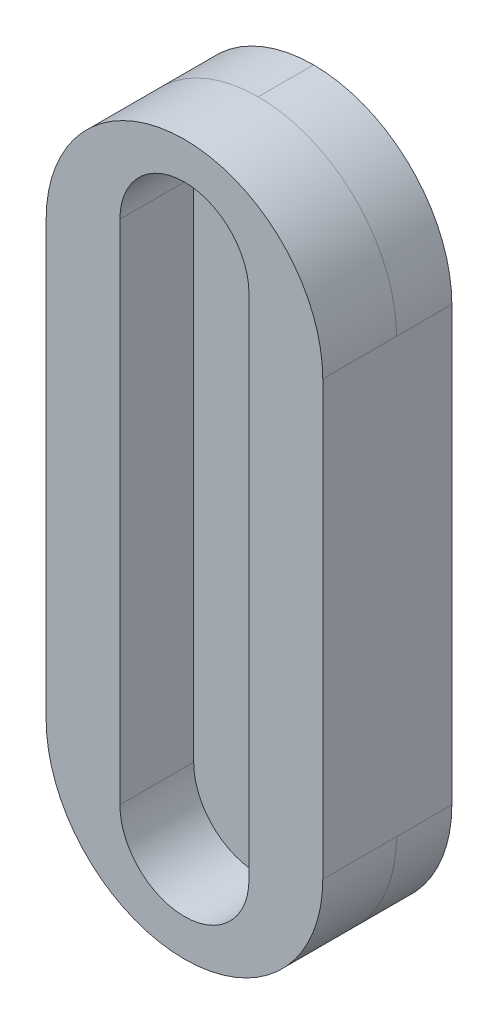
ISO-10303-21;
HEADER;
FILE_DESCRIPTION(('STEP AP214'),'2;1');
FILE_NAME('part.step','',(''),(''),'','','');
FILE_SCHEMA(('AUTOMOTIVE_DESIGN { 1 0 10303 214 1 1 1 1 }'));
ENDSEC;
DATA;
#1=APPLICATION_CONTEXT('core data for automotive mechanical design processes');
#2=APPLICATION_PROTOCOL_DEFINITION('international standard','automotive_design',2000,#1);
#3=PRODUCT_CONTEXT('',#1,'mechanical');
#4=PRODUCT('Part','Part','',(#3));
#5=PRODUCT_RELATED_PRODUCT_CATEGORY('part','',(#4));
#6=PRODUCT_DEFINITION_FORMATION('','',#4);
#7=PRODUCT_DEFINITION_CONTEXT('part definition',#1,'design');
#8=PRODUCT_DEFINITION('design','',#6,#7);
#9=PRODUCT_DEFINITION_SHAPE('','',#8);
#10=(LENGTH_UNIT() NAMED_UNIT(*) SI_UNIT(.MILLI.,.METRE.));
#11=(NAMED_UNIT(*) PLANE_ANGLE_UNIT() SI_UNIT($,.RADIAN.));
#12=(NAMED_UNIT(*) SI_UNIT($,.STERADIAN.) SOLID_ANGLE_UNIT());
#13=UNCERTAINTY_MEASURE_WITH_UNIT(LENGTH_MEASURE(1.E-05),#10,'distance_accuracy_value','');
#14=(GEOMETRIC_REPRESENTATION_CONTEXT(3) GLOBAL_UNCERTAINTY_ASSIGNED_CONTEXT((#13)) GLOBAL_UNIT_ASSIGNED_CONTEXT((#10,
#11,#12)) REPRESENTATION_CONTEXT('',''));
#15=CARTESIAN_POINT('',(0.,0.,0.));
#16=DIRECTION('',(0.,0.,1.));
#17=DIRECTION('',(1.,0.,0.));
#18=AXIS2_PLACEMENT_3D('',#15,#16,#17);
#19=CARTESIAN_POINT('',(3.75,0.,1.));
#20=DIRECTION('',(-1.,0.,0.));
#21=DIRECTION('',(0.,0.,1.));
#22=AXIS2_PLACEMENT_3D('',#19,#20,#21);
#23=PLANE('',#22);
#24=DIRECTION('',(0.,0.,-1.));
#25=VECTOR('',#24,1.);
#26=CARTESIAN_POINT('',(3.75,12.25,3.5));
#27=LINE('',#26,#25);
#28=CARTESIAN_POINT('',(3.75,12.25,3.5));
#29=VERTEX_POINT('',#28);
#30=CARTESIAN_POINT('',(3.75,12.25,1.5));
#31=VERTEX_POINT('',#30);
#32=EDGE_CURVE('E140',#29,#31,#27,.T.);
#33=ORIENTED_EDGE('',*,*,#32,.T.);
#34=DIRECTION('',(0.,0.,-1.));
#35=VECTOR('',#34,1.);
#36=CARTESIAN_POINT('',(3.75,12.25,1.));
#37=LINE('',#36,#35);
#38=CARTESIAN_POINT('',(3.75,12.25,0.));
#39=VERTEX_POINT('',#38);
#40=EDGE_CURVE('E198',#31,#39,#37,.T.);
#41=ORIENTED_EDGE('',*,*,#40,.T.);
#42=DIRECTION('',(0.,1.,0.));
#43=VECTOR('',#42,1.);
#44=CARTESIAN_POINT('',(3.75,0.,0.));
#45=LINE('',#44,#43);
#46=CARTESIAN_POINT('',(3.75,24.,0.));
#47=VERTEX_POINT('',#46);
#48=EDGE_CURVE('E182',#39,#47,#45,.T.);
#49=ORIENTED_EDGE('',*,*,#48,.T.);
#50=DIRECTION('',(0.,0.,-1.));
#51=VECTOR('',#50,1.);
#52=CARTESIAN_POINT('',(3.75,24.,1.));
#53=LINE('',#52,#51);
#54=CARTESIAN_POINT('',(3.75,24.,1.5));
#55=VERTEX_POINT('',#54);
#56=EDGE_CURVE('E194',#47,#55,#53,.F.);
#57=ORIENTED_EDGE('',*,*,#56,.T.);
#58=DIRECTION('',(0.,0.,-1.));
#59=VECTOR('',#58,1.);
#60=CARTESIAN_POINT('',(3.75,24.,3.5));
#61=LINE('',#60,#59);
#62=CARTESIAN_POINT('',(3.75,24.,3.5));
#63=VERTEX_POINT('',#62);
#64=EDGE_CURVE('E165',#63,#55,#61,.T.);
#65=ORIENTED_EDGE('',*,*,#64,.F.);
#66=DIRECTION('',(0.,1.,0.));
#67=VECTOR('',#66,1.);
#68=CARTESIAN_POINT('',(3.75,0.,3.5));
#69=LINE('',#68,#67);
#70=EDGE_CURVE('E144',#29,#63,#69,.T.);
#71=ORIENTED_EDGE('',*,*,#70,.F.);
#72=EDGE_LOOP('',(#33,#41,#49,#57,#65,#71));
#73=FACE_BOUND('',#72,.T.);
#74=ADVANCED_FACE('F41',(#73),#23,.F.);
#75=CARTESIAN_POINT('',(-3.75,0.,1.));
#76=DIRECTION('',(-1.,0.,0.));
#77=DIRECTION('',(0.,0.,1.));
#78=AXIS2_PLACEMENT_3D('',#75,#76,#77);
#79=PLANE('',#78);
#80=DIRECTION('',(0.,1.,0.));
#81=VECTOR('',#80,1.);
#82=CARTESIAN_POINT('',(-3.75,0.,0.));
#83=LINE('',#82,#81);
#84=CARTESIAN_POINT('',(-3.75,12.25,0.));
#85=VERTEX_POINT('',#84);
#86=CARTESIAN_POINT('',(-3.75,24.,0.));
#87=VERTEX_POINT('',#86);
#88=EDGE_CURVE('E186',#85,#87,#83,.T.);
#89=ORIENTED_EDGE('',*,*,#88,.F.);
#90=DIRECTION('',(0.,0.,-1.));
#91=VECTOR('',#90,1.);
#92=CARTESIAN_POINT('',(-3.75,12.25,1.5));
#93=LINE('',#92,#91);
#94=CARTESIAN_POINT('',(-3.75,12.25,1.5));
#95=VERTEX_POINT('',#94);
#96=EDGE_CURVE('E11',#85,#95,#93,.F.);
#97=ORIENTED_EDGE('',*,*,#96,.T.);
#98=DIRECTION('',(0.,0.,-1.));
#99=VECTOR('',#98,1.);
#100=CARTESIAN_POINT('',(-3.75,12.25,3.5));
#101=LINE('',#100,#99);
#102=CARTESIAN_POINT('',(-3.75,12.25,3.5));
#103=VERTEX_POINT('',#102);
#104=EDGE_CURVE('E137',#103,#95,#101,.T.);
#105=ORIENTED_EDGE('',*,*,#104,.F.);
#106=DIRECTION('',(0.,-1.,0.));
#107=VECTOR('',#106,1.);
#108=CARTESIAN_POINT('',(-3.75,0.,3.5));
#109=LINE('',#108,#107);
#110=CARTESIAN_POINT('',(-3.75,24.,3.5));
#111=VERTEX_POINT('',#110);
#112=EDGE_CURVE('E145',#111,#103,#109,.T.);
#113=ORIENTED_EDGE('',*,*,#112,.F.);
#114=DIRECTION('',(0.,0.,-1.));
#115=VECTOR('',#114,1.);
#116=CARTESIAN_POINT('',(-3.75,24.,3.5));
#117=LINE('',#116,#115);
#118=CARTESIAN_POINT('',(-3.75,24.,1.5));
#119=VERTEX_POINT('',#118);
#120=EDGE_CURVE('E265',#111,#119,#117,.T.);
#121=ORIENTED_EDGE('',*,*,#120,.T.);
#122=DIRECTION('',(0.,0.,-1.));
#123=VECTOR('',#122,1.);
#124=CARTESIAN_POINT('',(-3.75,24.,0.));
#125=LINE('',#124,#123);
#126=EDGE_CURVE('E51',#119,#87,#125,.T.);
#127=ORIENTED_EDGE('',*,*,#126,.T.);
#128=EDGE_LOOP('',(#89,#97,#105,#113,#121,#127));
#129=FACE_BOUND('',#128,.T.);
#130=ADVANCED_FACE('F156',(#129),#79,.T.);
#131=CARTESIAN_POINT('',(0.,24.,1.));
#132=DIRECTION('',(0.,0.,-1.));
#133=DIRECTION('',(-1.,0.,0.));
#134=AXIS2_PLACEMENT_3D('',#131,#132,#133);
#135=CYLINDRICAL_SURFACE('',#134,1.24999999999999);
#136=CARTESIAN_POINT('',(0.,24.,1.));
#137=DIRECTION('',(0.,0.,1.));
#138=DIRECTION('',(1.,0.,0.));
#139=AXIS2_PLACEMENT_3D('',#136,#137,#138);
#140=CIRCLE('',#139,1.24999999999999);
#141=CARTESIAN_POINT('',(1.24999999999999,24.,1.));
#142=VERTEX_POINT('',#141);
#143=EDGE_CURVE('E169',#142,#142,#140,.T.);
#144=ORIENTED_EDGE('',*,*,#143,.T.);
#145=EDGE_LOOP('',(#144));
#146=FACE_BOUND('',#145,.T.);
#147=CARTESIAN_POINT('',(0.,24.,0.));
#148=DIRECTION('',(0.,0.,1.));
#149=DIRECTION('',(1.,0.,0.));
#150=AXIS2_PLACEMENT_3D('',#147,#148,#149);
#151=CIRCLE('',#150,1.24999999999999);
#152=CARTESIAN_POINT('',(1.24999999999999,24.,0.));
#153=VERTEX_POINT('',#152);
#154=EDGE_CURVE('E173',#153,#153,#151,.T.);
#155=ORIENTED_EDGE('',*,*,#154,.F.);
#156=EDGE_LOOP('',(#155));
#157=FACE_BOUND('',#156,.T.);
#158=ADVANCED_FACE('F294',(#146,#157),#135,.F.);
#159=CARTESIAN_POINT('',(0.,20.,1.));
#160=DIRECTION('',(0.,0.,-1.));
#161=DIRECTION('',(-1.,0.,0.));
#162=AXIS2_PLACEMENT_3D('',#159,#160,#161);
#163=CYLINDRICAL_SURFACE('',#162,1.24999999999999);
#164=CARTESIAN_POINT('',(0.,20.,1.));
#165=DIRECTION('',(0.,0.,1.));
#166=DIRECTION('',(1.,0.,0.));
#167=AXIS2_PLACEMENT_3D('',#164,#165,#166);
#168=CIRCLE('',#167,1.24999999999999);
#169=CARTESIAN_POINT('',(1.24999999999999,20.,1.));
#170=VERTEX_POINT('',#169);
#171=EDGE_CURVE('E174',#170,#170,#168,.T.);
#172=ORIENTED_EDGE('',*,*,#171,.T.);
#173=EDGE_LOOP('',(#172));
#174=FACE_BOUND('',#173,.T.);
#175=CARTESIAN_POINT('',(0.,20.,0.));
#176=DIRECTION('',(0.,0.,1.));
#177=DIRECTION('',(1.,0.,0.));
#178=AXIS2_PLACEMENT_3D('',#175,#176,#177);
#179=CIRCLE('',#178,1.24999999999999);
#180=CARTESIAN_POINT('',(1.24999999999999,20.,0.));
#181=VERTEX_POINT('',#180);
#182=EDGE_CURVE('E189',#181,#181,#179,.T.);
#183=ORIENTED_EDGE('',*,*,#182,.F.);
#184=EDGE_LOOP('',(#183));
#185=FACE_BOUND('',#184,.T.);
#186=ADVANCED_FACE('F298',(#174,#185),#163,.F.);
#187=CARTESIAN_POINT('',(0.,0.,0.));
#188=DIRECTION('',(0.,0.,1.));
#189=DIRECTION('',(1.,0.,0.));
#190=AXIS2_PLACEMENT_3D('',#187,#188,#189);
#191=PLANE('',#190);
#192=ORIENTED_EDGE('',*,*,#154,.T.);
#193=EDGE_LOOP('',(#192));
#194=FACE_BOUND('',#193,.T.);
#195=ORIENTED_EDGE('',*,*,#48,.F.);
#196=CARTESIAN_POINT('',(0.,12.25,0.));
#197=DIRECTION('',(0.,0.,1.));
#198=DIRECTION('',(1.,0.,0.));
#199=AXIS2_PLACEMENT_3D('',#196,#197,#198);
#200=CIRCLE('',#199,3.75);
#201=CARTESIAN_POINT('',(0.,8.5,0.));
#202=VERTEX_POINT('',#201);
#203=EDGE_CURVE('E211',#39,#202,#200,.F.);
#204=ORIENTED_EDGE('',*,*,#203,.T.);
#205=CARTESIAN_POINT('',(0.,12.25,0.));
#206=DIRECTION('',(0.,0.,1.));
#207=DIRECTION('',(1.,0.,0.));
#208=AXIS2_PLACEMENT_3D('',#205,#206,#207);
#209=CIRCLE('',#208,3.75);
#210=EDGE_CURVE('E208',#202,#85,#209,.F.);
#211=ORIENTED_EDGE('',*,*,#210,.T.);
#212=ORIENTED_EDGE('',*,*,#88,.T.);
#213=CARTESIAN_POINT('',(0.,24.,0.));
#214=DIRECTION('',(0.,0.,1.));
#215=DIRECTION('',(1.,0.,0.));
#216=AXIS2_PLACEMENT_3D('',#213,#214,#215);
#217=CIRCLE('',#216,3.75);
#218=CARTESIAN_POINT('',(0.,27.75,0.));
#219=VERTEX_POINT('',#218);
#220=EDGE_CURVE('E59',#87,#219,#217,.F.);
#221=ORIENTED_EDGE('',*,*,#220,.T.);
#222=CARTESIAN_POINT('',(0.,24.,0.));
#223=DIRECTION('',(0.,0.,1.));
#224=DIRECTION('',(1.,0.,0.));
#225=AXIS2_PLACEMENT_3D('',#222,#223,#224);
#226=CIRCLE('',#225,3.75);
#227=EDGE_CURVE('E205',#219,#47,#226,.F.);
#228=ORIENTED_EDGE('',*,*,#227,.T.);
#229=EDGE_LOOP('',(#195,#204,#211,#212,#221,#228));
#230=FACE_BOUND('',#229,.T.);
#231=ORIENTED_EDGE('',*,*,#182,.T.);
#232=EDGE_LOOP('',(#231));
#233=FACE_BOUND('',#232,.T.);
#234=ADVANCED_FACE('F274',(#194,#230,#233),#191,.F.);
#235=CARTESIAN_POINT('',(0.,0.,1.));
#236=DIRECTION('',(0.,0.,1.));
#237=DIRECTION('',(1.,0.,0.));
#238=AXIS2_PLACEMENT_3D('',#235,#236,#237);
#239=PLANE('',#238);
#240=ORIENTED_EDGE('',*,*,#171,.F.);
#241=EDGE_LOOP('',(#240));
#242=FACE_BOUND('',#241,.T.);
#243=ADVANCED_FACE('F309',(#242),#239,.F.);
#244=ORIENTED_EDGE('',*,*,#143,.F.);
#245=EDGE_LOOP('',(#244));
#246=FACE_BOUND('',#245,.T.);
#247=ADVANCED_FACE('F314',(#246),#239,.F.);
#248=CARTESIAN_POINT('',(0.,25.,3.5));
#249=DIRECTION('',(0.,0.,-1.));
#250=DIRECTION('',(-1.,0.,0.));
#251=AXIS2_PLACEMENT_3D('',#248,#249,#250);
#252=CYLINDRICAL_SURFACE('',#251,1.75);
#253=CARTESIAN_POINT('',(0.,25.,1.5));
#254=DIRECTION('',(0.,0.,1.));
#255=DIRECTION('',(1.,0.,0.));
#256=AXIS2_PLACEMENT_3D('',#253,#254,#255);
#257=CIRCLE('',#256,1.75);
#258=CARTESIAN_POINT('',(1.75,25.,1.5));
#259=VERTEX_POINT('',#258);
#260=CARTESIAN_POINT('',(-1.75,25.,1.5));
#261=VERTEX_POINT('',#260);
#262=EDGE_CURVE('E239',#259,#261,#257,.T.);
#263=ORIENTED_EDGE('',*,*,#262,.F.);
#264=DIRECTION('',(0.,0.,-1.));
#265=VECTOR('',#264,1.);
#266=CARTESIAN_POINT('',(1.75,25.,3.5));
#267=LINE('',#266,#265);
#268=CARTESIAN_POINT('',(1.75,25.,3.5));
#269=VERTEX_POINT('',#268);
#270=EDGE_CURVE('E178',#269,#259,#267,.T.);
#271=ORIENTED_EDGE('',*,*,#270,.F.);
#272=CARTESIAN_POINT('',(0.,25.,3.5));
#273=DIRECTION('',(0.,0.,1.));
#274=DIRECTION('',(1.,0.,0.));
#275=AXIS2_PLACEMENT_3D('',#272,#273,#274);
#276=CIRCLE('',#275,1.75);
#277=CARTESIAN_POINT('',(-1.75,25.,3.5));
#278=VERTEX_POINT('',#277);
#279=EDGE_CURVE('E486',#269,#278,#276,.T.);
#280=ORIENTED_EDGE('',*,*,#279,.T.);
#281=DIRECTION('',(0.,0.,-1.));
#282=VECTOR('',#281,1.);
#283=CARTESIAN_POINT('',(-1.75,25.,3.5));
#284=LINE('',#283,#282);
#285=EDGE_CURVE('E159',#278,#261,#284,.T.);
#286=ORIENTED_EDGE('',*,*,#285,.T.);
#287=EDGE_LOOP('',(#263,#271,#280,#286));
#288=FACE_BOUND('',#287,.T.);
#289=ADVANCED_FACE('F319',(#288),#252,.F.);
#290=CARTESIAN_POINT('',(1.75,0.,3.5));
#291=DIRECTION('',(-1.,0.,0.));
#292=DIRECTION('',(0.,0.,1.));
#293=AXIS2_PLACEMENT_3D('',#290,#291,#292);
#294=PLANE('',#293);
#295=DIRECTION('',(0.,1.,0.));
#296=VECTOR('',#295,1.);
#297=CARTESIAN_POINT('',(1.75,0.,1.5));
#298=LINE('',#297,#296);
#299=CARTESIAN_POINT('',(1.75,11.25,1.5));
#300=VERTEX_POINT('',#299);
#301=EDGE_CURVE('E243',#300,#259,#298,.T.);
#302=ORIENTED_EDGE('',*,*,#301,.F.);
#303=DIRECTION('',(0.,0.,-1.));
#304=VECTOR('',#303,1.);
#305=CARTESIAN_POINT('',(1.75,11.25,3.5));
#306=LINE('',#305,#304);
#307=CARTESIAN_POINT('',(1.75,11.25,3.5));
#308=VERTEX_POINT('',#307);
#309=EDGE_CURVE('E259',#308,#300,#306,.T.);
#310=ORIENTED_EDGE('',*,*,#309,.F.);
#311=DIRECTION('',(0.,1.,0.));
#312=VECTOR('',#311,1.);
#313=CARTESIAN_POINT('',(1.75,0.,3.5));
#314=LINE('',#313,#312);
#315=EDGE_CURVE('E484',#308,#269,#314,.T.);
#316=ORIENTED_EDGE('',*,*,#315,.T.);
#317=ORIENTED_EDGE('',*,*,#270,.T.);
#318=EDGE_LOOP('',(#302,#310,#316,#317));
#319=FACE_BOUND('',#318,.T.);
#320=ADVANCED_FACE('F331',(#319),#294,.T.);
#321=CARTESIAN_POINT('',(0.,11.25,3.5));
#322=DIRECTION('',(0.,0.,-1.));
#323=DIRECTION('',(-1.,0.,0.));
#324=AXIS2_PLACEMENT_3D('',#321,#322,#323);
#325=CYLINDRICAL_SURFACE('',#324,1.75);
#326=CARTESIAN_POINT('',(0.,11.25,1.5));
#327=DIRECTION('',(0.,0.,1.));
#328=DIRECTION('',(1.,0.,0.));
#329=AXIS2_PLACEMENT_3D('',#326,#327,#328);
#330=CIRCLE('',#329,1.75);
#331=CARTESIAN_POINT('',(-1.75,11.25,1.5));
#332=VERTEX_POINT('',#331);
#333=EDGE_CURVE('E248',#332,#300,#330,.T.);
#334=ORIENTED_EDGE('',*,*,#333,.F.);
#335=DIRECTION('',(0.,0.,-1.));
#336=VECTOR('',#335,1.);
#337=CARTESIAN_POINT('',(-1.75,11.25,3.5));
#338=LINE('',#337,#336);
#339=CARTESIAN_POINT('',(-1.75,11.25,3.5));
#340=VERTEX_POINT('',#339);
#341=EDGE_CURVE('E163',#340,#332,#338,.T.);
#342=ORIENTED_EDGE('',*,*,#341,.F.);
#343=CARTESIAN_POINT('',(0.,11.25,3.5));
#344=DIRECTION('',(0.,0.,1.));
#345=DIRECTION('',(1.,0.,0.));
#346=AXIS2_PLACEMENT_3D('',#343,#344,#345);
#347=CIRCLE('',#346,1.75);
#348=EDGE_CURVE('E481',#340,#308,#347,.T.);
#349=ORIENTED_EDGE('',*,*,#348,.T.);
#350=ORIENTED_EDGE('',*,*,#309,.T.);
#351=EDGE_LOOP('',(#334,#342,#349,#350));
#352=FACE_BOUND('',#351,.T.);
#353=ADVANCED_FACE('F325',(#352),#325,.F.);
#354=CARTESIAN_POINT('',(0.,12.25,3.5));
#355=DIRECTION('',(0.,0.,-1.));
#356=DIRECTION('',(-1.,0.,0.));
#357=AXIS2_PLACEMENT_3D('',#354,#355,#356);
#358=CYLINDRICAL_SURFACE('',#357,3.75);
#359=CARTESIAN_POINT('',(0.,12.25,1.5));
#360=DIRECTION('',(0.,0.,1.));
#361=DIRECTION('',(1.,0.,0.));
#362=AXIS2_PLACEMENT_3D('',#359,#360,#361);
#363=CIRCLE('',#362,3.75);
#364=CARTESIAN_POINT('',(0.,8.5,1.5));
#365=VERTEX_POINT('',#364);
#366=EDGE_CURVE('E218',#95,#365,#363,.T.);
#367=ORIENTED_EDGE('',*,*,#366,.T.);
#368=EDGE_CURVE('E193',#365,#31,#363,.T.);
#369=ORIENTED_EDGE('',*,*,#368,.T.);
#370=ORIENTED_EDGE('',*,*,#32,.F.);
#371=CARTESIAN_POINT('',(0.,12.25,3.5));
#372=DIRECTION('',(0.,0.,1.));
#373=DIRECTION('',(1.,0.,0.));
#374=AXIS2_PLACEMENT_3D('',#371,#372,#373);
#375=CIRCLE('',#374,3.75);
#376=EDGE_CURVE('E133',#103,#29,#375,.T.);
#377=ORIENTED_EDGE('',*,*,#376,.F.);
#378=ORIENTED_EDGE('',*,*,#104,.T.);
#379=EDGE_LOOP('',(#367,#369,#370,#377,#378));
#380=FACE_BOUND('',#379,.T.);
#381=ADVANCED_FACE('F135',(#380),#358,.T.);
#382=CARTESIAN_POINT('',(0.,24.,3.5));
#383=DIRECTION('',(0.,0.,-1.));
#384=DIRECTION('',(-1.,0.,0.));
#385=AXIS2_PLACEMENT_3D('',#382,#383,#384);
#386=CYLINDRICAL_SURFACE('',#385,3.75);
#387=CARTESIAN_POINT('',(0.,24.,1.5));
#388=DIRECTION('',(0.,0.,1.));
#389=DIRECTION('',(1.,0.,0.));
#390=AXIS2_PLACEMENT_3D('',#387,#388,#389);
#391=CIRCLE('',#390,3.75);
#392=CARTESIAN_POINT('',(0.,27.75,1.5));
#393=VERTEX_POINT('',#392);
#394=EDGE_CURVE('E224',#55,#393,#391,.T.);
#395=ORIENTED_EDGE('',*,*,#394,.T.);
#396=EDGE_CURVE('E199',#393,#119,#391,.T.);
#397=ORIENTED_EDGE('',*,*,#396,.T.);
#398=ORIENTED_EDGE('',*,*,#120,.F.);
#399=CARTESIAN_POINT('',(0.,24.,3.5));
#400=DIRECTION('',(0.,0.,1.));
#401=DIRECTION('',(1.,0.,0.));
#402=AXIS2_PLACEMENT_3D('',#399,#400,#401);
#403=CIRCLE('',#402,3.75);
#404=EDGE_CURVE('E151',#63,#111,#403,.T.);
#405=ORIENTED_EDGE('',*,*,#404,.F.);
#406=ORIENTED_EDGE('',*,*,#64,.T.);
#407=EDGE_LOOP('',(#395,#397,#398,#405,#406));
#408=FACE_BOUND('',#407,.T.);
#409=ADVANCED_FACE('F270',(#408),#386,.T.);
#410=CARTESIAN_POINT('',(-1.75,0.,3.5));
#411=DIRECTION('',(-1.,0.,0.));
#412=DIRECTION('',(0.,0.,1.));
#413=AXIS2_PLACEMENT_3D('',#410,#411,#412);
#414=PLANE('',#413);
#415=DIRECTION('',(0.,1.,0.));
#416=VECTOR('',#415,1.);
#417=CARTESIAN_POINT('',(-1.75,0.,1.5));
#418=LINE('',#417,#416);
#419=EDGE_CURVE('E154',#332,#261,#418,.T.);
#420=ORIENTED_EDGE('',*,*,#419,.T.);
#421=ORIENTED_EDGE('',*,*,#285,.F.);
#422=DIRECTION('',(0.,1.,0.));
#423=VECTOR('',#422,1.);
#424=CARTESIAN_POINT('',(-1.75,0.,3.5));
#425=LINE('',#424,#423);
#426=EDGE_CURVE('E267',#340,#278,#425,.T.);
#427=ORIENTED_EDGE('',*,*,#426,.F.);
#428=ORIENTED_EDGE('',*,*,#341,.T.);
#429=EDGE_LOOP('',(#420,#421,#427,#428));
#430=FACE_BOUND('',#429,.T.);
#431=ADVANCED_FACE('F328',(#430),#414,.F.);
#432=CARTESIAN_POINT('',(0.,0.,3.5));
#433=DIRECTION('',(0.,0.,1.));
#434=DIRECTION('',(1.,0.,0.));
#435=AXIS2_PLACEMENT_3D('',#432,#433,#434);
#436=PLANE('',#435);
#437=ORIENTED_EDGE('',*,*,#112,.T.);
#438=ORIENTED_EDGE('',*,*,#376,.T.);
#439=ORIENTED_EDGE('',*,*,#70,.T.);
#440=ORIENTED_EDGE('',*,*,#404,.T.);
#441=EDGE_LOOP('',(#437,#438,#439,#440));
#442=FACE_BOUND('',#441,.T.);
#443=ORIENTED_EDGE('',*,*,#279,.F.);
#444=ORIENTED_EDGE('',*,*,#315,.F.);
#445=ORIENTED_EDGE('',*,*,#348,.F.);
#446=ORIENTED_EDGE('',*,*,#426,.T.);
#447=EDGE_LOOP('',(#443,#444,#445,#446));
#448=FACE_BOUND('',#447,.T.);
#449=ADVANCED_FACE('F148',(#442,#448),#436,.T.);
#450=CARTESIAN_POINT('',(0.,0.,1.5));
#451=DIRECTION('',(0.,0.,1.));
#452=DIRECTION('',(1.,0.,0.));
#453=AXIS2_PLACEMENT_3D('',#450,#451,#452);
#454=PLANE('',#453);
#455=ORIENTED_EDGE('',*,*,#301,.T.);
#456=ORIENTED_EDGE('',*,*,#262,.T.);
#457=ORIENTED_EDGE('',*,*,#419,.F.);
#458=ORIENTED_EDGE('',*,*,#333,.T.);
#459=EDGE_LOOP('',(#455,#456,#457,#458));
#460=FACE_BOUND('',#459,.T.);
#461=ADVANCED_FACE('F286',(#460),#454,.T.);
#462=CARTESIAN_POINT('',(0.,12.25,1.));
#463=DIRECTION('',(0.,0.,1.));
#464=DIRECTION('',(1.,0.,0.));
#465=AXIS2_PLACEMENT_3D('',#462,#463,#464);
#466=CYLINDRICAL_SURFACE('',#465,3.75);
#467=DIRECTION('',(0.,0.,-1.));
#468=VECTOR('',#467,1.);
#469=CARTESIAN_POINT('',(0.,8.5,0.));
#470=LINE('',#469,#468);
#471=EDGE_CURVE('E215',#365,#202,#470,.T.);
#472=ORIENTED_EDGE('',*,*,#471,.F.);
#473=ORIENTED_EDGE('',*,*,#366,.F.);
#474=ORIENTED_EDGE('',*,*,#96,.F.);
#475=ORIENTED_EDGE('',*,*,#210,.F.);
#476=EDGE_LOOP('',(#472,#473,#474,#475));
#477=FACE_BOUND('',#476,.T.);
#478=ADVANCED_FACE('F278',(#477),#466,.T.);
#479=CARTESIAN_POINT('',(0.,12.25,1.));
#480=DIRECTION('',(0.,0.,-1.));
#481=DIRECTION('',(-1.,0.,0.));
#482=AXIS2_PLACEMENT_3D('',#479,#480,#481);
#483=CYLINDRICAL_SURFACE('',#482,3.75);
#484=ORIENTED_EDGE('',*,*,#368,.F.);
#485=ORIENTED_EDGE('',*,*,#471,.T.);
#486=ORIENTED_EDGE('',*,*,#203,.F.);
#487=ORIENTED_EDGE('',*,*,#40,.F.);
#488=EDGE_LOOP('',(#484,#485,#486,#487));
#489=FACE_BOUND('',#488,.T.);
#490=ADVANCED_FACE('F279',(#489),#483,.T.);
#491=CARTESIAN_POINT('',(0.,24.,1.));
#492=DIRECTION('',(0.,0.,1.));
#493=DIRECTION('',(1.,0.,0.));
#494=AXIS2_PLACEMENT_3D('',#491,#492,#493);
#495=CYLINDRICAL_SURFACE('',#494,3.75);
#496=ORIENTED_EDGE('',*,*,#126,.F.);
#497=ORIENTED_EDGE('',*,*,#396,.F.);
#498=DIRECTION('',(0.,0.,-1.));
#499=VECTOR('',#498,1.);
#500=CARTESIAN_POINT('',(0.,27.75,1.5));
#501=LINE('',#500,#499);
#502=EDGE_CURVE('E45',#219,#393,#501,.F.);
#503=ORIENTED_EDGE('',*,*,#502,.F.);
#504=ORIENTED_EDGE('',*,*,#220,.F.);
#505=EDGE_LOOP('',(#496,#497,#503,#504));
#506=FACE_BOUND('',#505,.T.);
#507=ADVANCED_FACE('F43',(#506),#495,.T.);
#508=CARTESIAN_POINT('',(0.,24.,1.));
#509=DIRECTION('',(0.,0.,-1.));
#510=DIRECTION('',(-1.,0.,0.));
#511=AXIS2_PLACEMENT_3D('',#508,#509,#510);
#512=CYLINDRICAL_SURFACE('',#511,3.75);
#513=ORIENTED_EDGE('',*,*,#394,.F.);
#514=ORIENTED_EDGE('',*,*,#56,.F.);
#515=ORIENTED_EDGE('',*,*,#227,.F.);
#516=ORIENTED_EDGE('',*,*,#502,.T.);
#517=EDGE_LOOP('',(#513,#514,#515,#516));
#518=FACE_BOUND('',#517,.T.);
#519=ADVANCED_FACE('F229',(#518),#512,.T.);
#520=CLOSED_SHELL('',(#74,#130,#158,#186,#234,#243,#247,#289,#320,#353,#381,#409,#431,#449,#461,
#478,#490,#507,#519));
#521=MANIFOLD_SOLID_BREP('B2',#520);
#522=ADVANCED_BREP_SHAPE_REPRESENTATION('',(#18,#521),#14);
#523=SHAPE_DEFINITION_REPRESENTATION(#9,#522);
ENDSEC;
END-ISO-10303-21;
